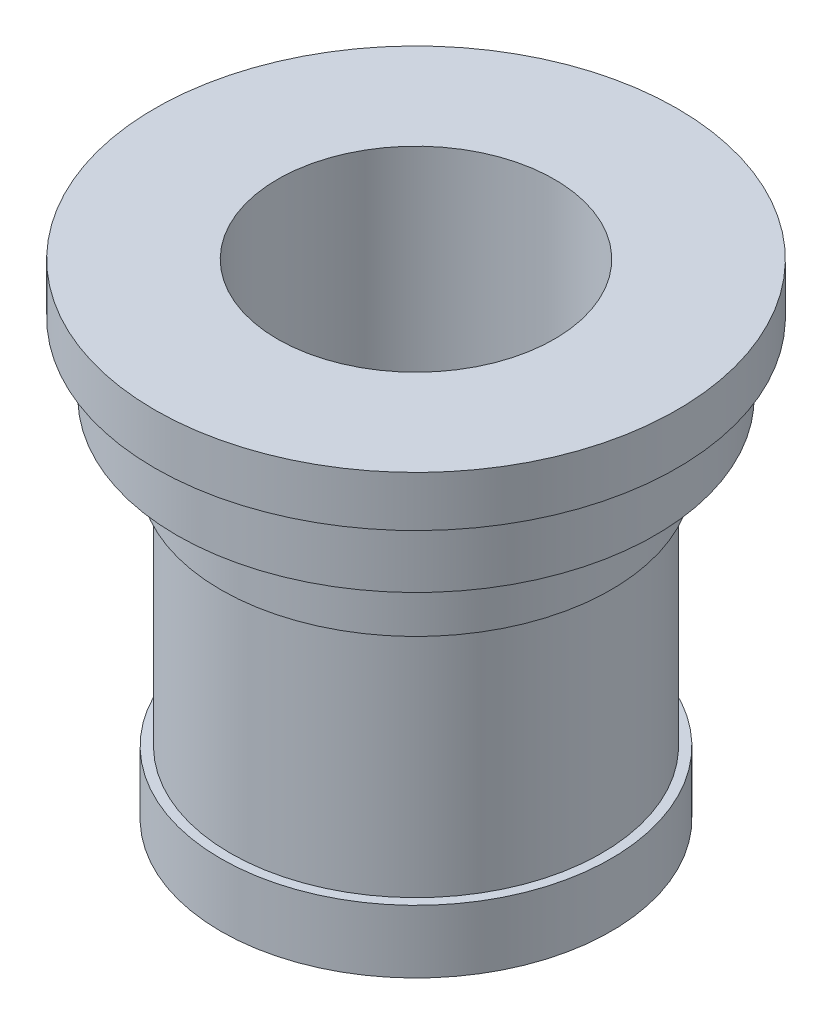
ISO-10303-21;
HEADER;
FILE_DESCRIPTION(('STEP AP214'),'2;1');
FILE_NAME('part.step','',(''),(''),'','','');
FILE_SCHEMA(('AUTOMOTIVE_DESIGN { 1 0 10303 214 1 1 1 1 }'));
ENDSEC;
DATA;
#1=APPLICATION_CONTEXT('core data for automotive mechanical design processes');
#2=APPLICATION_PROTOCOL_DEFINITION('international standard','automotive_design',2000,#1);
#3=PRODUCT_CONTEXT('',#1,'mechanical');
#4=PRODUCT('Part','Part','',(#3));
#5=PRODUCT_RELATED_PRODUCT_CATEGORY('part','',(#4));
#6=PRODUCT_DEFINITION_FORMATION('','',#4);
#7=PRODUCT_DEFINITION_CONTEXT('part definition',#1,'design');
#8=PRODUCT_DEFINITION('design','',#6,#7);
#9=PRODUCT_DEFINITION_SHAPE('','',#8);
#10=(LENGTH_UNIT() NAMED_UNIT(*) SI_UNIT(.MILLI.,.METRE.));
#11=(NAMED_UNIT(*) PLANE_ANGLE_UNIT() SI_UNIT($,.RADIAN.));
#12=(NAMED_UNIT(*) SI_UNIT($,.STERADIAN.) SOLID_ANGLE_UNIT());
#13=UNCERTAINTY_MEASURE_WITH_UNIT(LENGTH_MEASURE(1.E-05),#10,'distance_accuracy_value','');
#14=(GEOMETRIC_REPRESENTATION_CONTEXT(3) GLOBAL_UNCERTAINTY_ASSIGNED_CONTEXT((#13)) GLOBAL_UNIT_ASSIGNED_CONTEXT((#10,
#11,#12)) REPRESENTATION_CONTEXT('',''));
#15=CARTESIAN_POINT('',(0.,0.,0.));
#16=DIRECTION('',(0.,0.,1.));
#17=DIRECTION('',(1.,0.,0.));
#18=AXIS2_PLACEMENT_3D('',#15,#16,#17);
#19=CARTESIAN_POINT('',(0.,10.,0.));
#20=DIRECTION('',(0.,-1.,0.));
#21=DIRECTION('',(0.,0.,-1.));
#22=AXIS2_PLACEMENT_3D('',#19,#20,#21);
#23=CYLINDRICAL_SURFACE('',#22,31.);
#24=CARTESIAN_POINT('',(0.,10.,0.));
#25=DIRECTION('',(0.,1.,0.));
#26=DIRECTION('',(0.,0.,1.));
#27=AXIS2_PLACEMENT_3D('',#24,#25,#26);
#28=CIRCLE('',#27,31.);
#29=CARTESIAN_POINT('',(0.,10.,31.));
#30=VERTEX_POINT('',#29);
#31=EDGE_CURVE('E114',#30,#30,#28,.T.);
#32=ORIENTED_EDGE('',*,*,#31,.F.);
#33=EDGE_LOOP('',(#32));
#34=FACE_BOUND('',#33,.T.);
#35=CARTESIAN_POINT('',(0.,0.,0.));
#36=DIRECTION('',(0.,1.,0.));
#37=DIRECTION('',(0.,0.,1.));
#38=AXIS2_PLACEMENT_3D('',#35,#36,#37);
#39=CIRCLE('',#38,31.);
#40=CARTESIAN_POINT('',(0.,0.,31.));
#41=VERTEX_POINT('',#40);
#42=EDGE_CURVE('E111',#41,#41,#39,.T.);
#43=ORIENTED_EDGE('',*,*,#42,.T.);
#44=EDGE_LOOP('',(#43));
#45=FACE_BOUND('',#44,.T.);
#46=ADVANCED_FACE('F45',(#34,#45),#23,.T.);
#47=CARTESIAN_POINT('',(0.,10.,0.));
#48=DIRECTION('',(0.,1.,0.));
#49=DIRECTION('',(0.,0.,1.));
#50=AXIS2_PLACEMENT_3D('',#47,#48,#49);
#51=PLANE('',#50);
#52=CARTESIAN_POINT('',(0.,10.,0.));
#53=DIRECTION('',(0.,1.,0.));
#54=DIRECTION('',(0.,0.,1.));
#55=AXIS2_PLACEMENT_3D('',#52,#53,#54);
#56=CIRCLE('',#55,29.5);
#57=CARTESIAN_POINT('',(0.,10.,29.5));
#58=VERTEX_POINT('',#57);
#59=EDGE_CURVE('E105',#58,#58,#56,.T.);
#60=ORIENTED_EDGE('',*,*,#59,.F.);
#61=EDGE_LOOP('',(#60));
#62=FACE_BOUND('',#61,.T.);
#63=ORIENTED_EDGE('',*,*,#31,.T.);
#64=EDGE_LOOP('',(#63));
#65=FACE_BOUND('',#64,.T.);
#66=ADVANCED_FACE('F123',(#62,#65),#51,.T.);
#67=CARTESIAN_POINT('',(0.,0.,0.));
#68=DIRECTION('',(0.,1.,0.));
#69=DIRECTION('',(0.,0.,1.));
#70=AXIS2_PLACEMENT_3D('',#67,#68,#69);
#71=PLANE('',#70);
#72=CARTESIAN_POINT('',(0.,0.,0.));
#73=DIRECTION('',(0.,1.,0.));
#74=DIRECTION('',(0.,0.,1.));
#75=AXIS2_PLACEMENT_3D('',#72,#73,#74);
#76=CIRCLE('',#75,22.);
#77=CARTESIAN_POINT('',(1.49912810403716,0.,21.9488636363636));
#78=VERTEX_POINT('',#77);
#79=CARTESIAN_POINT('',(-1.49912810403716,0.,21.9488636363636));
#80=VERTEX_POINT('',#79);
#81=EDGE_CURVE('E79',#78,#80,#76,.T.);
#82=ORIENTED_EDGE('',*,*,#81,.T.);
#83=CARTESIAN_POINT('',(0.,0.,22.));
#84=DIRECTION('',(0.,-1.,0.));
#85=DIRECTION('',(0.,0.,-1.));
#86=AXIS2_PLACEMENT_3D('',#83,#84,#85);
#87=CIRCLE('',#86,1.5);
#88=EDGE_CURVE('E71',#78,#80,#87,.T.);
#89=ORIENTED_EDGE('',*,*,#88,.F.);
#90=EDGE_LOOP('',(#82,#89));
#91=FACE_BOUND('',#90,.T.);
#92=ORIENTED_EDGE('',*,*,#42,.F.);
#93=EDGE_LOOP('',(#92));
#94=FACE_BOUND('',#93,.T.);
#95=ADVANCED_FACE('F77',(#91,#94),#71,.F.);
#96=CARTESIAN_POINT('',(0.,47.,0.));
#97=DIRECTION('',(0.,-1.,0.));
#98=DIRECTION('',(0.,0.,-1.));
#99=AXIS2_PLACEMENT_3D('',#96,#97,#98);
#100=CYLINDRICAL_SURFACE('',#99,29.5);
#101=CARTESIAN_POINT('',(0.,47.,0.));
#102=DIRECTION('',(0.,1.,0.));
#103=DIRECTION('',(0.,0.,1.));
#104=AXIS2_PLACEMENT_3D('',#101,#102,#103);
#105=CIRCLE('',#104,29.5);
#106=CARTESIAN_POINT('',(0.,47.,29.5));
#107=VERTEX_POINT('',#106);
#108=EDGE_CURVE('E108',#107,#107,#105,.T.);
#109=ORIENTED_EDGE('',*,*,#108,.F.);
#110=EDGE_LOOP('',(#109));
#111=FACE_BOUND('',#110,.T.);
#112=ORIENTED_EDGE('',*,*,#59,.T.);
#113=EDGE_LOOP('',(#112));
#114=FACE_BOUND('',#113,.T.);
#115=ADVANCED_FACE('F122',(#111,#114),#100,.T.);
#116=CARTESIAN_POINT('',(0.,58.,0.));
#117=DIRECTION('',(0.,-1.,0.));
#118=DIRECTION('',(0.,0.,-1.));
#119=AXIS2_PLACEMENT_3D('',#116,#117,#118);
#120=CYLINDRICAL_SURFACE('',#119,31.);
#121=CARTESIAN_POINT('',(0.,58.,0.));
#122=DIRECTION('',(0.,1.,0.));
#123=DIRECTION('',(0.,0.,1.));
#124=AXIS2_PLACEMENT_3D('',#121,#122,#123);
#125=CIRCLE('',#124,31.);
#126=CARTESIAN_POINT('',(0.,58.,31.));
#127=VERTEX_POINT('',#126);
#128=EDGE_CURVE('E102',#127,#127,#125,.T.);
#129=ORIENTED_EDGE('',*,*,#128,.F.);
#130=EDGE_LOOP('',(#129));
#131=FACE_BOUND('',#130,.T.);
#132=CARTESIAN_POINT('',(0.,47.,0.));
#133=DIRECTION('',(0.,1.,0.));
#134=DIRECTION('',(0.,0.,1.));
#135=AXIS2_PLACEMENT_3D('',#132,#133,#134);
#136=CIRCLE('',#135,31.);
#137=CARTESIAN_POINT('',(0.,47.,31.));
#138=VERTEX_POINT('',#137);
#139=EDGE_CURVE('E99',#138,#138,#136,.T.);
#140=ORIENTED_EDGE('',*,*,#139,.T.);
#141=EDGE_LOOP('',(#140));
#142=FACE_BOUND('',#141,.T.);
#143=ADVANCED_FACE('F128',(#131,#142),#120,.T.);
#144=CARTESIAN_POINT('',(0.,47.,0.));
#145=DIRECTION('',(0.,1.,0.));
#146=DIRECTION('',(0.,0.,1.));
#147=AXIS2_PLACEMENT_3D('',#144,#145,#146);
#148=PLANE('',#147);
#149=ORIENTED_EDGE('',*,*,#108,.T.);
#150=EDGE_LOOP('',(#149));
#151=FACE_BOUND('',#150,.T.);
#152=ORIENTED_EDGE('',*,*,#139,.F.);
#153=EDGE_LOOP('',(#152));
#154=FACE_BOUND('',#153,.T.);
#155=ADVANCED_FACE('F159',(#151,#154),#148,.F.);
#156=CARTESIAN_POINT('',(0.,69.,0.));
#157=DIRECTION('',(0.,-1.,0.));
#158=DIRECTION('',(0.,0.,-1.));
#159=AXIS2_PLACEMENT_3D('',#156,#157,#158);
#160=CYLINDRICAL_SURFACE('',#159,38.);
#161=CARTESIAN_POINT('',(0.,69.,0.));
#162=DIRECTION('',(0.,1.,0.));
#163=DIRECTION('',(0.,0.,1.));
#164=AXIS2_PLACEMENT_3D('',#161,#162,#163);
#165=CIRCLE('',#164,38.);
#166=CARTESIAN_POINT('',(0.,69.,38.));
#167=VERTEX_POINT('',#166);
#168=EDGE_CURVE('E96',#167,#167,#165,.T.);
#169=ORIENTED_EDGE('',*,*,#168,.F.);
#170=EDGE_LOOP('',(#169));
#171=FACE_BOUND('',#170,.T.);
#172=CARTESIAN_POINT('',(0.,58.,0.));
#173=DIRECTION('',(0.,1.,0.));
#174=DIRECTION('',(0.,0.,1.));
#175=AXIS2_PLACEMENT_3D('',#172,#173,#174);
#176=CIRCLE('',#175,38.);
#177=CARTESIAN_POINT('',(0.,58.,38.));
#178=VERTEX_POINT('',#177);
#179=EDGE_CURVE('E94',#178,#178,#176,.T.);
#180=ORIENTED_EDGE('',*,*,#179,.T.);
#181=EDGE_LOOP('',(#180));
#182=FACE_BOUND('',#181,.T.);
#183=ADVANCED_FACE('F169',(#171,#182),#160,.T.);
#184=CARTESIAN_POINT('',(0.,58.,0.));
#185=DIRECTION('',(0.,1.,0.));
#186=DIRECTION('',(0.,0.,1.));
#187=AXIS2_PLACEMENT_3D('',#184,#185,#186);
#188=PLANE('',#187);
#189=ORIENTED_EDGE('',*,*,#128,.T.);
#190=EDGE_LOOP('',(#189));
#191=FACE_BOUND('',#190,.T.);
#192=ORIENTED_EDGE('',*,*,#179,.F.);
#193=EDGE_LOOP('',(#192));
#194=FACE_BOUND('',#193,.T.);
#195=ADVANCED_FACE('F179',(#191,#194),#188,.F.);
#196=CARTESIAN_POINT('',(0.,77.,0.));
#197=DIRECTION('',(0.,-1.,0.));
#198=DIRECTION('',(0.,0.,-1.));
#199=AXIS2_PLACEMENT_3D('',#196,#197,#198);
#200=CYLINDRICAL_SURFACE('',#199,41.5);
#201=CARTESIAN_POINT('',(0.,77.,0.));
#202=DIRECTION('',(0.,1.,0.));
#203=DIRECTION('',(0.,0.,1.));
#204=AXIS2_PLACEMENT_3D('',#201,#202,#203);
#205=CIRCLE('',#204,41.5);
#206=CARTESIAN_POINT('',(0.,77.,41.5));
#207=VERTEX_POINT('',#206);
#208=EDGE_CURVE('E87',#207,#207,#205,.T.);
#209=ORIENTED_EDGE('',*,*,#208,.F.);
#210=EDGE_LOOP('',(#209));
#211=FACE_BOUND('',#210,.T.);
#212=CARTESIAN_POINT('',(0.,69.,0.));
#213=DIRECTION('',(0.,1.,0.));
#214=DIRECTION('',(0.,0.,1.));
#215=AXIS2_PLACEMENT_3D('',#212,#213,#214);
#216=CIRCLE('',#215,41.5);
#217=CARTESIAN_POINT('',(0.,69.,41.5));
#218=VERTEX_POINT('',#217);
#219=EDGE_CURVE('E83',#218,#218,#216,.T.);
#220=ORIENTED_EDGE('',*,*,#219,.T.);
#221=EDGE_LOOP('',(#220));
#222=FACE_BOUND('',#221,.T.);
#223=ADVANCED_FACE('F189',(#211,#222),#200,.T.);
#224=CARTESIAN_POINT('',(0.,77.,0.));
#225=DIRECTION('',(0.,1.,0.));
#226=DIRECTION('',(0.,0.,1.));
#227=AXIS2_PLACEMENT_3D('',#224,#225,#226);
#228=PLANE('',#227);
#229=CARTESIAN_POINT('',(0.,77.,0.));
#230=DIRECTION('',(0.,1.,0.));
#231=DIRECTION('',(0.,0.,1.));
#232=AXIS2_PLACEMENT_3D('',#229,#230,#231);
#233=CIRCLE('',#232,22.);
#234=CARTESIAN_POINT('',(0.,77.,22.));
#235=VERTEX_POINT('',#234);
#236=EDGE_CURVE('E84',#235,#235,#233,.T.);
#237=ORIENTED_EDGE('',*,*,#236,.F.);
#238=EDGE_LOOP('',(#237));
#239=FACE_BOUND('',#238,.T.);
#240=ORIENTED_EDGE('',*,*,#208,.T.);
#241=EDGE_LOOP('',(#240));
#242=FACE_BOUND('',#241,.T.);
#243=ADVANCED_FACE('F199',(#239,#242),#228,.T.);
#244=CARTESIAN_POINT('',(0.,69.,0.));
#245=DIRECTION('',(0.,1.,0.));
#246=DIRECTION('',(0.,0.,1.));
#247=AXIS2_PLACEMENT_3D('',#244,#245,#246);
#248=PLANE('',#247);
#249=ORIENTED_EDGE('',*,*,#168,.T.);
#250=EDGE_LOOP('',(#249));
#251=FACE_BOUND('',#250,.T.);
#252=ORIENTED_EDGE('',*,*,#219,.F.);
#253=EDGE_LOOP('',(#252));
#254=FACE_BOUND('',#253,.T.);
#255=ADVANCED_FACE('F207',(#251,#254),#248,.F.);
#256=CARTESIAN_POINT('',(0.,0.,0.));
#257=DIRECTION('',(0.,1.,0.));
#258=DIRECTION('',(0.,0.,1.));
#259=AXIS2_PLACEMENT_3D('',#256,#257,#258);
#260=CYLINDRICAL_SURFACE('',#259,22.);
#261=ORIENTED_EDGE('',*,*,#81,.F.);
#262=DIRECTION('',(0.,-1.,0.));
#263=VECTOR('',#262,1.);
#264=CARTESIAN_POINT('',(1.49912810403716,2.5,21.9488636363636));
#265=LINE('',#264,#263);
#266=CARTESIAN_POINT('',(1.49912810403716,5.,21.9488636363636));
#267=VERTEX_POINT('',#266);
#268=EDGE_CURVE('E13',#78,#267,#265,.F.);
#269=ORIENTED_EDGE('',*,*,#268,.T.);
#270=CARTESIAN_POINT('',(0.,5.,0.));
#271=DIRECTION('',(0.,-1.,0.));
#272=DIRECTION('',(0.,0.,-1.));
#273=AXIS2_PLACEMENT_3D('',#270,#271,#272);
#274=CIRCLE('',#273,22.);
#275=CARTESIAN_POINT('',(-1.49912810403716,5.,21.9488636363636));
#276=VERTEX_POINT('',#275);
#277=EDGE_CURVE('E62',#276,#267,#274,.F.);
#278=ORIENTED_EDGE('',*,*,#277,.F.);
#279=DIRECTION('',(0.,-1.,0.));
#280=VECTOR('',#279,1.);
#281=CARTESIAN_POINT('',(-1.49912810403716,2.5,21.9488636363636));
#282=LINE('',#281,#280);
#283=EDGE_CURVE('E52',#276,#80,#282,.T.);
#284=ORIENTED_EDGE('',*,*,#283,.T.);
#285=EDGE_LOOP('',(#261,#269,#278,#284));
#286=FACE_BOUND('',#285,.T.);
#287=ORIENTED_EDGE('',*,*,#236,.T.);
#288=EDGE_LOOP('',(#287));
#289=FACE_BOUND('',#288,.T.);
#290=ADVANCED_FACE('F81',(#286,#289),#260,.F.);
#291=CARTESIAN_POINT('',(0.,5.,22.));
#292=DIRECTION('',(0.,-1.,0.));
#293=DIRECTION('',(0.,0.,-1.));
#294=AXIS2_PLACEMENT_3D('',#291,#292,#293);
#295=CYLINDRICAL_SURFACE('',#294,1.5);
#296=ORIENTED_EDGE('',*,*,#88,.T.);
#297=ORIENTED_EDGE('',*,*,#283,.F.);
#298=CARTESIAN_POINT('',(0.,5.,22.));
#299=DIRECTION('',(0.,-1.,0.));
#300=DIRECTION('',(0.,0.,-1.));
#301=AXIS2_PLACEMENT_3D('',#298,#299,#300);
#302=CIRCLE('',#301,1.5);
#303=EDGE_CURVE('E58',#267,#276,#302,.T.);
#304=ORIENTED_EDGE('',*,*,#303,.F.);
#305=ORIENTED_EDGE('',*,*,#268,.F.);
#306=EDGE_LOOP('',(#296,#297,#304,#305));
#307=FACE_BOUND('',#306,.T.);
#308=ADVANCED_FACE('F70',(#307),#295,.F.);
#309=CARTESIAN_POINT('',(0.,5.,22.));
#310=DIRECTION('',(0.,-1.,0.));
#311=DIRECTION('',(0.,0.,-1.));
#312=AXIS2_PLACEMENT_3D('',#309,#310,#311);
#313=PLANE('',#312);
#314=ORIENTED_EDGE('',*,*,#277,.T.);
#315=ORIENTED_EDGE('',*,*,#303,.T.);
#316=EDGE_LOOP('',(#314,#315));
#317=FACE_BOUND('',#316,.T.);
#318=ADVANCED_FACE('F239',(#317),#313,.T.);
#319=CLOSED_SHELL('',(#46,#66,#95,#115,#143,#155,#183,#195,#223,#243,#255,#290,#308,#318));
#320=MANIFOLD_SOLID_BREP('B2',#319);
#321=ADVANCED_BREP_SHAPE_REPRESENTATION('',(#18,#320),#14);
#322=SHAPE_DEFINITION_REPRESENTATION(#9,#321);
ENDSEC;
END-ISO-10303-21;
